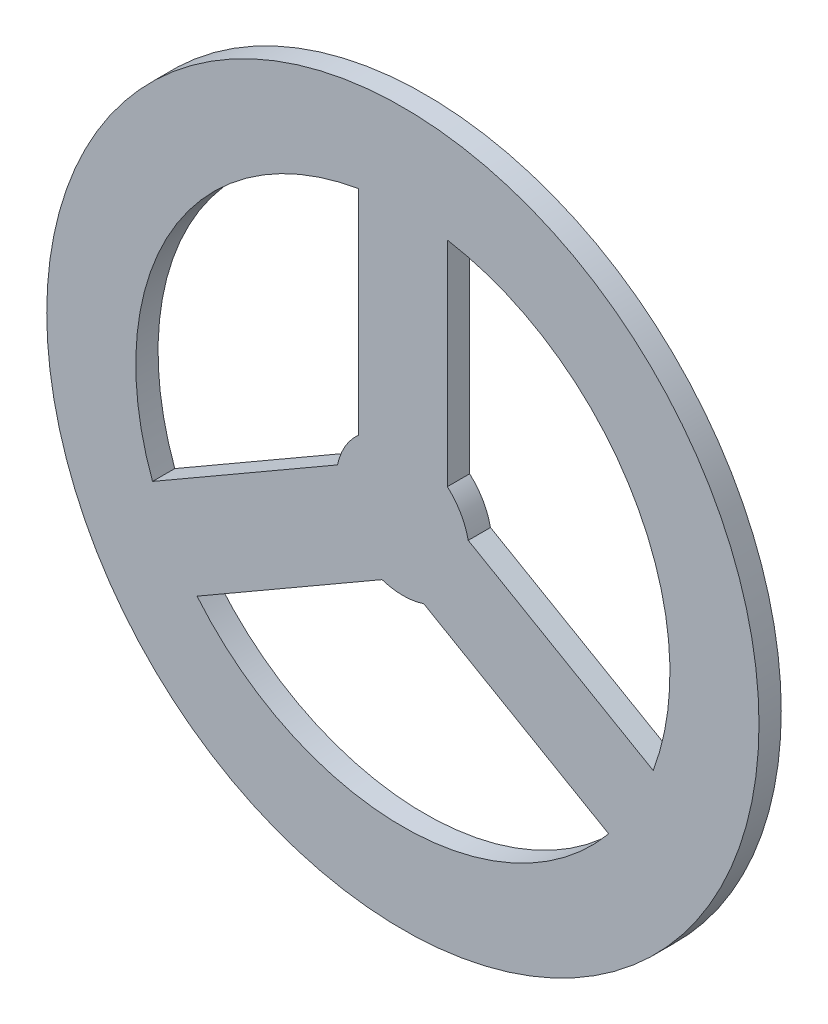
ISO-10303-21;
HEADER;
FILE_DESCRIPTION(('STEP AP214'),'2;1');
FILE_NAME('part.step','',(''),(''),'','','');
FILE_SCHEMA(('AUTOMOTIVE_DESIGN { 1 0 10303 214 1 1 1 1 }'));
ENDSEC;
DATA;
#1=APPLICATION_CONTEXT('core data for automotive mechanical design processes');
#2=APPLICATION_PROTOCOL_DEFINITION('international standard','automotive_design',2000,#1);
#3=PRODUCT_CONTEXT('',#1,'mechanical');
#4=PRODUCT('Part','Part','',(#3));
#5=PRODUCT_RELATED_PRODUCT_CATEGORY('part','',(#4));
#6=PRODUCT_DEFINITION_FORMATION('','',#4);
#7=PRODUCT_DEFINITION_CONTEXT('part definition',#1,'design');
#8=PRODUCT_DEFINITION('design','',#6,#7);
#9=PRODUCT_DEFINITION_SHAPE('','',#8);
#10=(LENGTH_UNIT() NAMED_UNIT(*) SI_UNIT(.MILLI.,.METRE.));
#11=(NAMED_UNIT(*) PLANE_ANGLE_UNIT() SI_UNIT($,.RADIAN.));
#12=(NAMED_UNIT(*) SI_UNIT($,.STERADIAN.) SOLID_ANGLE_UNIT());
#13=UNCERTAINTY_MEASURE_WITH_UNIT(LENGTH_MEASURE(1.E-05),#10,'distance_accuracy_value','');
#14=(GEOMETRIC_REPRESENTATION_CONTEXT(3) GLOBAL_UNCERTAINTY_ASSIGNED_CONTEXT((#13)) GLOBAL_UNIT_ASSIGNED_CONTEXT((#10,
#11,#12)) REPRESENTATION_CONTEXT('',''));
#15=CARTESIAN_POINT('',(0.,0.,0.));
#16=DIRECTION('',(0.,0.,1.));
#17=DIRECTION('',(1.,0.,0.));
#18=AXIS2_PLACEMENT_3D('',#15,#16,#17);
#19=CARTESIAN_POINT('',(0.,0.,6.35));
#20=DIRECTION('',(0.,0.,1.));
#21=DIRECTION('',(1.,0.,0.));
#22=AXIS2_PLACEMENT_3D('',#19,#20,#21);
#23=PLANE('',#22);
#24=CARTESIAN_POINT('',(0.,0.,6.35));
#25=DIRECTION('',(0.,0.,1.));
#26=DIRECTION('',(1.,0.,0.));
#27=AXIS2_PLACEMENT_3D('',#24,#25,#26);
#28=CIRCLE('',#27,101.6);
#29=CARTESIAN_POINT('',(101.6,0.,6.35));
#30=VERTEX_POINT('',#29);
#31=EDGE_CURVE('E11',#30,#30,#28,.T.);
#32=ORIENTED_EDGE('',*,*,#31,.T.);
#33=EDGE_LOOP('',(#32));
#34=FACE_BOUND('',#33,.T.);
#35=DIRECTION('',(0.866025403784436,-0.500000000000004,0.));
#36=VECTOR('',#35,1.);
#37=CARTESIAN_POINT('',(18.6467221242086,3.89900679950046,6.35));
#38=LINE('',#37,#36);
#39=CARTESIAN_POINT('',(18.6467221242086,3.89900679950046,6.35));
#40=VERTEX_POINT('',#39);
#41=CARTESIAN_POINT('',(71.4181373638433,-26.5685839946205,6.35));
#42=VERTEX_POINT('',#41);
#43=EDGE_CURVE('E191',#40,#42,#38,.T.);
#44=ORIENTED_EDGE('',*,*,#43,.F.);
#45=CARTESIAN_POINT('',(0.,0.,6.35));
#46=DIRECTION('',(0.,0.,-1.));
#47=DIRECTION('',(1.,0.,0.));
#48=AXIS2_PLACEMENT_3D('',#45,#46,#47);
#49=CIRCLE('',#48,19.05);
#50=CARTESIAN_POINT('',(12.7,14.1990316571237,6.35));
#51=VERTEX_POINT('',#50);
#52=EDGE_CURVE('E189',#51,#40,#49,.T.);
#53=ORIENTED_EDGE('',*,*,#52,.F.);
#54=DIRECTION('',(0.,-1.,0.));
#55=VECTOR('',#54,1.);
#56=CARTESIAN_POINT('',(12.7,14.1990316571237,6.35));
#57=LINE('',#56,#55);
#58=CARTESIAN_POINT('',(12.7,75.1342132453651,6.35));
#59=VERTEX_POINT('',#58);
#60=EDGE_CURVE('E197',#59,#51,#57,.T.);
#61=ORIENTED_EDGE('',*,*,#60,.F.);
#62=CARTESIAN_POINT('',(0.,0.,6.35));
#63=DIRECTION('',(0.,0.,1.));
#64=DIRECTION('',(1.,0.,0.));
#65=AXIS2_PLACEMENT_3D('',#62,#63,#64);
#66=CIRCLE('',#65,76.2);
#67=EDGE_CURVE('E194',#42,#59,#66,.T.);
#68=ORIENTED_EDGE('',*,*,#67,.F.);
#69=EDGE_LOOP('',(#44,#53,#61,#68));
#70=FACE_BOUND('',#69,.T.);
#71=DIRECTION('',(0.,1.,0.));
#72=VECTOR('',#71,1.);
#73=CARTESIAN_POINT('',(-12.7,14.1990316571237,6.35));
#74=LINE('',#73,#72);
#75=CARTESIAN_POINT('',(-12.7,14.1990316571237,6.35));
#76=VERTEX_POINT('',#75);
#77=CARTESIAN_POINT('',(-12.7,75.1342132453651,6.35));
#78=VERTEX_POINT('',#77);
#79=EDGE_CURVE('E160',#76,#78,#74,.T.);
#80=ORIENTED_EDGE('',*,*,#79,.F.);
#81=CARTESIAN_POINT('',(0.,0.,6.35));
#82=DIRECTION('',(0.,0.,-1.));
#83=DIRECTION('',(1.,0.,0.));
#84=AXIS2_PLACEMENT_3D('',#81,#82,#83);
#85=CIRCLE('',#84,19.05);
#86=CARTESIAN_POINT('',(-18.6467221242085,3.89900679950071,6.35));
#87=VERTEX_POINT('',#86);
#88=EDGE_CURVE('E158',#87,#76,#85,.T.);
#89=ORIENTED_EDGE('',*,*,#88,.F.);
#90=DIRECTION('',(0.866025403784443,0.499999999999992,0.));
#91=VECTOR('',#90,1.);
#92=CARTESIAN_POINT('',(-18.6467221242085,3.89900679950071,6.35));
#93=LINE('',#92,#91);
#94=CARTESIAN_POINT('',(-71.4181373638437,-26.5685839946195,6.35));
#95=VERTEX_POINT('',#94);
#96=EDGE_CURVE('E166',#95,#87,#93,.T.);
#97=ORIENTED_EDGE('',*,*,#96,.F.);
#98=CARTESIAN_POINT('',(0.,0.,6.35));
#99=DIRECTION('',(0.,0.,1.));
#100=DIRECTION('',(1.,0.,0.));
#101=AXIS2_PLACEMENT_3D('',#98,#99,#100);
#102=CIRCLE('',#101,76.2);
#103=EDGE_CURVE('E163',#78,#95,#102,.T.);
#104=ORIENTED_EDGE('',*,*,#103,.F.);
#105=EDGE_LOOP('',(#80,#89,#97,#104));
#106=FACE_BOUND('',#105,.T.);
#107=DIRECTION('',(-0.866025403784443,-0.499999999999992,0.));
#108=VECTOR('',#107,1.);
#109=CARTESIAN_POINT('',(-5.94672212420871,-18.0980384566241,6.35));
#110=LINE('',#109,#108);
#111=CARTESIAN_POINT('',(-5.94672212420871,-18.0980384566241,6.35));
#112=VERTEX_POINT('',#111);
#113=CARTESIAN_POINT('',(-58.7181373638439,-48.5656292507444,6.35));
#114=VERTEX_POINT('',#113);
#115=EDGE_CURVE('E130',#112,#114,#110,.T.);
#116=ORIENTED_EDGE('',*,*,#115,.F.);
#117=CARTESIAN_POINT('',(0.,0.,6.35));
#118=DIRECTION('',(0.,0.,-1.));
#119=DIRECTION('',(1.,0.,0.));
#120=AXIS2_PLACEMENT_3D('',#117,#118,#119);
#121=CIRCLE('',#120,19.05);
#122=CARTESIAN_POINT('',(5.94672212420847,-18.0980384566242,6.35));
#123=VERTEX_POINT('',#122);
#124=EDGE_CURVE('E122',#123,#112,#121,.T.);
#125=ORIENTED_EDGE('',*,*,#124,.F.);
#126=DIRECTION('',(-0.866025403784436,0.500000000000004,0.));
#127=VECTOR('',#126,1.);
#128=CARTESIAN_POINT('',(5.94672212420847,-18.0980384566242,6.35));
#129=LINE('',#128,#127);
#130=CARTESIAN_POINT('',(58.7181373638432,-48.5656292507452,6.35));
#131=VERTEX_POINT('',#130);
#132=EDGE_CURVE('E144',#131,#123,#129,.T.);
#133=ORIENTED_EDGE('',*,*,#132,.F.);
#134=CARTESIAN_POINT('',(0.,0.,6.35));
#135=DIRECTION('',(0.,0.,1.));
#136=DIRECTION('',(1.,0.,0.));
#137=AXIS2_PLACEMENT_3D('',#134,#135,#136);
#138=CIRCLE('',#137,76.2);
#139=EDGE_CURVE('E142',#114,#131,#138,.T.);
#140=ORIENTED_EDGE('',*,*,#139,.F.);
#141=EDGE_LOOP('',(#116,#125,#133,#140));
#142=FACE_BOUND('',#141,.T.);
#143=ADVANCED_FACE('F33',(#34,#70,#106,#142),#23,.T.);
#144=CARTESIAN_POINT('',(0.,0.,0.));
#145=DIRECTION('',(0.,0.,1.));
#146=DIRECTION('',(1.,0.,0.));
#147=AXIS2_PLACEMENT_3D('',#144,#145,#146);
#148=PLANE('',#147);
#149=CARTESIAN_POINT('',(0.,0.,0.));
#150=DIRECTION('',(0.,0.,-1.));
#151=DIRECTION('',(1.,0.,0.));
#152=AXIS2_PLACEMENT_3D('',#149,#150,#151);
#153=CIRCLE('',#152,19.05);
#154=CARTESIAN_POINT('',(-18.6467221242085,3.89900679950071,0.));
#155=VERTEX_POINT('',#154);
#156=CARTESIAN_POINT('',(-12.7,14.1990316571237,0.));
#157=VERTEX_POINT('',#156);
#158=EDGE_CURVE('E138',#155,#157,#153,.T.);
#159=ORIENTED_EDGE('',*,*,#158,.T.);
#160=DIRECTION('',(0.,1.,0.));
#161=VECTOR('',#160,1.);
#162=CARTESIAN_POINT('',(-12.7,14.1990316571237,0.));
#163=LINE('',#162,#161);
#164=CARTESIAN_POINT('',(-12.7,75.1342132453651,0.));
#165=VERTEX_POINT('',#164);
#166=EDGE_CURVE('E171',#157,#165,#163,.T.);
#167=ORIENTED_EDGE('',*,*,#166,.T.);
#168=CARTESIAN_POINT('',(0.,0.,0.));
#169=DIRECTION('',(0.,0.,1.));
#170=DIRECTION('',(1.,0.,0.));
#171=AXIS2_PLACEMENT_3D('',#168,#169,#170);
#172=CIRCLE('',#171,76.2);
#173=CARTESIAN_POINT('',(-71.4181373638437,-26.5685839946195,0.));
#174=VERTEX_POINT('',#173);
#175=EDGE_CURVE('E174',#165,#174,#172,.T.);
#176=ORIENTED_EDGE('',*,*,#175,.T.);
#177=DIRECTION('',(0.866025403784443,0.499999999999992,0.));
#178=VECTOR('',#177,1.);
#179=CARTESIAN_POINT('',(-18.6467221242085,3.89900679950071,0.));
#180=LINE('',#179,#178);
#181=EDGE_CURVE('E161',#174,#155,#180,.T.);
#182=ORIENTED_EDGE('',*,*,#181,.T.);
#183=EDGE_LOOP('',(#159,#167,#176,#182));
#184=FACE_BOUND('',#183,.T.);
#185=CARTESIAN_POINT('',(0.,0.,0.));
#186=DIRECTION('',(0.,0.,1.));
#187=DIRECTION('',(1.,0.,0.));
#188=AXIS2_PLACEMENT_3D('',#185,#186,#187);
#189=CIRCLE('',#188,101.6);
#190=CARTESIAN_POINT('',(101.6,0.,0.));
#191=VERTEX_POINT('',#190);
#192=EDGE_CURVE('E37',#191,#191,#189,.T.);
#193=ORIENTED_EDGE('',*,*,#192,.F.);
#194=EDGE_LOOP('',(#193));
#195=FACE_BOUND('',#194,.T.);
#196=CARTESIAN_POINT('',(0.,0.,0.));
#197=DIRECTION('',(0.,0.,-1.));
#198=DIRECTION('',(1.,0.,0.));
#199=AXIS2_PLACEMENT_3D('',#196,#197,#198);
#200=CIRCLE('',#199,19.05);
#201=CARTESIAN_POINT('',(12.7,14.1990316571237,0.));
#202=VERTEX_POINT('',#201);
#203=CARTESIAN_POINT('',(18.6467221242086,3.89900679950046,0.));
#204=VERTEX_POINT('',#203);
#205=EDGE_CURVE('E188',#202,#204,#200,.T.);
#206=ORIENTED_EDGE('',*,*,#205,.T.);
#207=DIRECTION('',(0.866025403784436,-0.500000000000004,0.));
#208=VECTOR('',#207,1.);
#209=CARTESIAN_POINT('',(18.6467221242086,3.89900679950046,0.));
#210=LINE('',#209,#208);
#211=CARTESIAN_POINT('',(71.4181373638433,-26.5685839946205,0.));
#212=VERTEX_POINT('',#211);
#213=EDGE_CURVE('E202',#204,#212,#210,.T.);
#214=ORIENTED_EDGE('',*,*,#213,.T.);
#215=CARTESIAN_POINT('',(0.,0.,0.));
#216=DIRECTION('',(0.,0.,1.));
#217=DIRECTION('',(1.,0.,0.));
#218=AXIS2_PLACEMENT_3D('',#215,#216,#217);
#219=CIRCLE('',#218,76.2);
#220=CARTESIAN_POINT('',(12.7,75.1342132453651,0.));
#221=VERTEX_POINT('',#220);
#222=EDGE_CURVE('E205',#212,#221,#219,.T.);
#223=ORIENTED_EDGE('',*,*,#222,.T.);
#224=DIRECTION('',(0.,-1.,0.));
#225=VECTOR('',#224,1.);
#226=CARTESIAN_POINT('',(12.7,14.1990316571237,0.));
#227=LINE('',#226,#225);
#228=EDGE_CURVE('E192',#221,#202,#227,.T.);
#229=ORIENTED_EDGE('',*,*,#228,.T.);
#230=EDGE_LOOP('',(#206,#214,#223,#229));
#231=FACE_BOUND('',#230,.T.);
#232=CARTESIAN_POINT('',(0.,0.,0.));
#233=DIRECTION('',(0.,0.,-1.));
#234=DIRECTION('',(1.,0.,0.));
#235=AXIS2_PLACEMENT_3D('',#232,#233,#234);
#236=CIRCLE('',#235,19.05);
#237=CARTESIAN_POINT('',(5.94672212420847,-18.0980384566242,0.));
#238=VERTEX_POINT('',#237);
#239=CARTESIAN_POINT('',(-5.94672212420871,-18.0980384566241,0.));
#240=VERTEX_POINT('',#239);
#241=EDGE_CURVE('E56',#238,#240,#236,.T.);
#242=ORIENTED_EDGE('',*,*,#241,.T.);
#243=DIRECTION('',(-0.866025403784443,-0.499999999999992,0.));
#244=VECTOR('',#243,1.);
#245=CARTESIAN_POINT('',(-5.94672212420871,-18.0980384566241,0.));
#246=LINE('',#245,#244);
#247=CARTESIAN_POINT('',(-58.7181373638439,-48.5656292507444,0.));
#248=VERTEX_POINT('',#247);
#249=EDGE_CURVE('E137',#240,#248,#246,.T.);
#250=ORIENTED_EDGE('',*,*,#249,.T.);
#251=CARTESIAN_POINT('',(0.,0.,0.));
#252=DIRECTION('',(0.,0.,1.));
#253=DIRECTION('',(1.,0.,0.));
#254=AXIS2_PLACEMENT_3D('',#251,#252,#253);
#255=CIRCLE('',#254,76.2);
#256=CARTESIAN_POINT('',(58.7181373638432,-48.5656292507452,0.));
#257=VERTEX_POINT('',#256);
#258=EDGE_CURVE('E150',#248,#257,#255,.T.);
#259=ORIENTED_EDGE('',*,*,#258,.T.);
#260=DIRECTION('',(-0.866025403784436,0.500000000000004,0.));
#261=VECTOR('',#260,1.);
#262=CARTESIAN_POINT('',(5.94672212420847,-18.0980384566242,0.));
#263=LINE('',#262,#261);
#264=EDGE_CURVE('E131',#257,#238,#263,.T.);
#265=ORIENTED_EDGE('',*,*,#264,.T.);
#266=EDGE_LOOP('',(#242,#250,#259,#265));
#267=FACE_BOUND('',#266,.T.);
#268=ADVANCED_FACE('F224',(#184,#195,#231,#267),#148,.F.);
#269=CARTESIAN_POINT('',(0.,0.,6.35));
#270=DIRECTION('',(0.,0.,-1.));
#271=DIRECTION('',(-1.,0.,0.));
#272=AXIS2_PLACEMENT_3D('',#269,#270,#271);
#273=CYLINDRICAL_SURFACE('',#272,101.6);
#274=ORIENTED_EDGE('',*,*,#31,.F.);
#275=EDGE_LOOP('',(#274));
#276=FACE_BOUND('',#275,.T.);
#277=ORIENTED_EDGE('',*,*,#192,.T.);
#278=EDGE_LOOP('',(#277));
#279=FACE_BOUND('',#278,.T.);
#280=ADVANCED_FACE('F35',(#276,#279),#273,.T.);
#281=CARTESIAN_POINT('',(0.,0.,6.35));
#282=DIRECTION('',(0.,0.,-1.));
#283=DIRECTION('',(-1.,0.,0.));
#284=AXIS2_PLACEMENT_3D('',#281,#282,#283);
#285=CYLINDRICAL_SURFACE('',#284,19.05);
#286=ORIENTED_EDGE('',*,*,#205,.F.);
#287=DIRECTION('',(0.,0.,-1.));
#288=VECTOR('',#287,1.);
#289=CARTESIAN_POINT('',(12.7,14.1990316571237,6.35));
#290=LINE('',#289,#288);
#291=EDGE_CURVE('E199',#51,#202,#290,.T.);
#292=ORIENTED_EDGE('',*,*,#291,.F.);
#293=ORIENTED_EDGE('',*,*,#52,.T.);
#294=DIRECTION('',(0.,0.,-1.));
#295=VECTOR('',#294,1.);
#296=CARTESIAN_POINT('',(18.6467221242086,3.89900679950046,6.35));
#297=LINE('',#296,#295);
#298=EDGE_CURVE('E216',#40,#204,#297,.T.);
#299=ORIENTED_EDGE('',*,*,#298,.T.);
#300=EDGE_LOOP('',(#286,#292,#293,#299));
#301=FACE_BOUND('',#300,.T.);
#302=ADVANCED_FACE('F246',(#301),#285,.T.);
#303=CARTESIAN_POINT('',(18.6467221242086,3.89900679950046,6.35));
#304=DIRECTION('',(0.500000000000004,0.866025403784436,0.));
#305=DIRECTION('',(-0.866025403784436,0.500000000000004,0.));
#306=AXIS2_PLACEMENT_3D('',#303,#304,#305);
#307=PLANE('',#306);
#308=ORIENTED_EDGE('',*,*,#213,.F.);
#309=ORIENTED_EDGE('',*,*,#298,.F.);
#310=ORIENTED_EDGE('',*,*,#43,.T.);
#311=DIRECTION('',(0.,0.,-1.));
#312=VECTOR('',#311,1.);
#313=CARTESIAN_POINT('',(71.4181373638433,-26.5685839946205,6.35));
#314=LINE('',#313,#312);
#315=EDGE_CURVE('E214',#42,#212,#314,.T.);
#316=ORIENTED_EDGE('',*,*,#315,.T.);
#317=EDGE_LOOP('',(#308,#309,#310,#316));
#318=FACE_BOUND('',#317,.T.);
#319=ADVANCED_FACE('F249',(#318),#307,.T.);
#320=CARTESIAN_POINT('',(0.,0.,6.35));
#321=DIRECTION('',(0.,0.,-1.));
#322=DIRECTION('',(-1.,0.,0.));
#323=AXIS2_PLACEMENT_3D('',#320,#321,#322);
#324=CYLINDRICAL_SURFACE('',#323,76.2);
#325=ORIENTED_EDGE('',*,*,#222,.F.);
#326=ORIENTED_EDGE('',*,*,#315,.F.);
#327=ORIENTED_EDGE('',*,*,#67,.T.);
#328=DIRECTION('',(0.,0.,-1.));
#329=VECTOR('',#328,1.);
#330=CARTESIAN_POINT('',(12.7,75.1342132453651,6.35));
#331=LINE('',#330,#329);
#332=EDGE_CURVE('E212',#59,#221,#331,.T.);
#333=ORIENTED_EDGE('',*,*,#332,.T.);
#334=EDGE_LOOP('',(#325,#326,#327,#333));
#335=FACE_BOUND('',#334,.T.);
#336=ADVANCED_FACE('F252',(#335),#324,.F.);
#337=CARTESIAN_POINT('',(12.7,14.1990316571237,6.35));
#338=DIRECTION('',(1.,0.,0.));
#339=DIRECTION('',(0.,0.,-1.));
#340=AXIS2_PLACEMENT_3D('',#337,#338,#339);
#341=PLANE('',#340);
#342=ORIENTED_EDGE('',*,*,#228,.F.);
#343=ORIENTED_EDGE('',*,*,#332,.F.);
#344=ORIENTED_EDGE('',*,*,#60,.T.);
#345=ORIENTED_EDGE('',*,*,#291,.T.);
#346=EDGE_LOOP('',(#342,#343,#344,#345));
#347=FACE_BOUND('',#346,.T.);
#348=ADVANCED_FACE('F256',(#347),#341,.T.);
#349=CARTESIAN_POINT('',(0.,0.,6.35));
#350=DIRECTION('',(0.,0.,-1.));
#351=DIRECTION('',(-1.,0.,0.));
#352=AXIS2_PLACEMENT_3D('',#349,#350,#351);
#353=CYLINDRICAL_SURFACE('',#352,19.05);
#354=ORIENTED_EDGE('',*,*,#158,.F.);
#355=DIRECTION('',(0.,0.,-1.));
#356=VECTOR('',#355,1.);
#357=CARTESIAN_POINT('',(-18.6467221242085,3.89900679950071,6.35));
#358=LINE('',#357,#356);
#359=EDGE_CURVE('E168',#87,#155,#358,.T.);
#360=ORIENTED_EDGE('',*,*,#359,.F.);
#361=ORIENTED_EDGE('',*,*,#88,.T.);
#362=DIRECTION('',(0.,0.,-1.));
#363=VECTOR('',#362,1.);
#364=CARTESIAN_POINT('',(-12.7,14.1990316571237,6.35));
#365=LINE('',#364,#363);
#366=EDGE_CURVE('E185',#76,#157,#365,.T.);
#367=ORIENTED_EDGE('',*,*,#366,.T.);
#368=EDGE_LOOP('',(#354,#360,#361,#367));
#369=FACE_BOUND('',#368,.T.);
#370=ADVANCED_FACE('F260',(#369),#353,.T.);
#371=CARTESIAN_POINT('',(-12.7,14.1990316571237,6.35));
#372=DIRECTION('',(-1.,0.,0.));
#373=DIRECTION('',(0.,0.,1.));
#374=AXIS2_PLACEMENT_3D('',#371,#372,#373);
#375=PLANE('',#374);
#376=ORIENTED_EDGE('',*,*,#166,.F.);
#377=ORIENTED_EDGE('',*,*,#366,.F.);
#378=ORIENTED_EDGE('',*,*,#79,.T.);
#379=DIRECTION('',(0.,0.,-1.));
#380=VECTOR('',#379,1.);
#381=CARTESIAN_POINT('',(-12.7,75.1342132453651,6.35));
#382=LINE('',#381,#380);
#383=EDGE_CURVE('E183',#78,#165,#382,.T.);
#384=ORIENTED_EDGE('',*,*,#383,.T.);
#385=EDGE_LOOP('',(#376,#377,#378,#384));
#386=FACE_BOUND('',#385,.T.);
#387=ADVANCED_FACE('F264',(#386),#375,.T.);
#388=CARTESIAN_POINT('',(0.,0.,6.35));
#389=DIRECTION('',(0.,0.,-1.));
#390=DIRECTION('',(-1.,0.,0.));
#391=AXIS2_PLACEMENT_3D('',#388,#389,#390);
#392=CYLINDRICAL_SURFACE('',#391,76.2);
#393=ORIENTED_EDGE('',*,*,#175,.F.);
#394=ORIENTED_EDGE('',*,*,#383,.F.);
#395=ORIENTED_EDGE('',*,*,#103,.T.);
#396=DIRECTION('',(0.,0.,-1.));
#397=VECTOR('',#396,1.);
#398=CARTESIAN_POINT('',(-71.4181373638437,-26.5685839946195,6.35));
#399=LINE('',#398,#397);
#400=EDGE_CURVE('E181',#95,#174,#399,.T.);
#401=ORIENTED_EDGE('',*,*,#400,.T.);
#402=EDGE_LOOP('',(#393,#394,#395,#401));
#403=FACE_BOUND('',#402,.T.);
#404=ADVANCED_FACE('F268',(#403),#392,.F.);
#405=CARTESIAN_POINT('',(-18.6467221242085,3.89900679950071,6.35));
#406=DIRECTION('',(-0.499999999999992,0.866025403784443,0.));
#407=DIRECTION('',(-0.866025403784443,-0.499999999999992,0.));
#408=AXIS2_PLACEMENT_3D('',#405,#406,#407);
#409=PLANE('',#408);
#410=ORIENTED_EDGE('',*,*,#181,.F.);
#411=ORIENTED_EDGE('',*,*,#400,.F.);
#412=ORIENTED_EDGE('',*,*,#96,.T.);
#413=ORIENTED_EDGE('',*,*,#359,.T.);
#414=EDGE_LOOP('',(#410,#411,#412,#413));
#415=FACE_BOUND('',#414,.T.);
#416=ADVANCED_FACE('F272',(#415),#409,.T.);
#417=CARTESIAN_POINT('',(0.,0.,6.35));
#418=DIRECTION('',(0.,0.,-1.));
#419=DIRECTION('',(-1.,0.,0.));
#420=AXIS2_PLACEMENT_3D('',#417,#418,#419);
#421=CYLINDRICAL_SURFACE('',#420,19.05);
#422=ORIENTED_EDGE('',*,*,#241,.F.);
#423=DIRECTION('',(0.,0.,-1.));
#424=VECTOR('',#423,1.);
#425=CARTESIAN_POINT('',(5.94672212420847,-18.0980384566242,6.35));
#426=LINE('',#425,#424);
#427=EDGE_CURVE('E126',#123,#238,#426,.T.);
#428=ORIENTED_EDGE('',*,*,#427,.F.);
#429=ORIENTED_EDGE('',*,*,#124,.T.);
#430=DIRECTION('',(0.,0.,-1.));
#431=VECTOR('',#430,1.);
#432=CARTESIAN_POINT('',(-5.94672212420871,-18.0980384566241,6.35));
#433=LINE('',#432,#431);
#434=EDGE_CURVE('E125',#112,#240,#433,.T.);
#435=ORIENTED_EDGE('',*,*,#434,.T.);
#436=EDGE_LOOP('',(#422,#428,#429,#435));
#437=FACE_BOUND('',#436,.T.);
#438=ADVANCED_FACE('F124',(#437),#421,.T.);
#439=CARTESIAN_POINT('',(-5.94672212420871,-18.0980384566241,6.35));
#440=DIRECTION('',(0.499999999999992,-0.866025403784443,0.));
#441=DIRECTION('',(0.866025403784443,0.499999999999992,0.));
#442=AXIS2_PLACEMENT_3D('',#439,#440,#441);
#443=PLANE('',#442);
#444=ORIENTED_EDGE('',*,*,#249,.F.);
#445=ORIENTED_EDGE('',*,*,#434,.F.);
#446=ORIENTED_EDGE('',*,*,#115,.T.);
#447=DIRECTION('',(0.,0.,-1.));
#448=VECTOR('',#447,1.);
#449=CARTESIAN_POINT('',(-58.7181373638439,-48.5656292507444,6.35));
#450=LINE('',#449,#448);
#451=EDGE_CURVE('E139',#114,#248,#450,.T.);
#452=ORIENTED_EDGE('',*,*,#451,.T.);
#453=EDGE_LOOP('',(#444,#445,#446,#452));
#454=FACE_BOUND('',#453,.T.);
#455=ADVANCED_FACE('F134',(#454),#443,.T.);
#456=CARTESIAN_POINT('',(0.,0.,6.35));
#457=DIRECTION('',(0.,0.,-1.));
#458=DIRECTION('',(-1.,0.,0.));
#459=AXIS2_PLACEMENT_3D('',#456,#457,#458);
#460=CYLINDRICAL_SURFACE('',#459,76.2);
#461=ORIENTED_EDGE('',*,*,#258,.F.);
#462=ORIENTED_EDGE('',*,*,#451,.F.);
#463=ORIENTED_EDGE('',*,*,#139,.T.);
#464=DIRECTION('',(0.,0.,-1.));
#465=VECTOR('',#464,1.);
#466=CARTESIAN_POINT('',(58.7181373638432,-48.5656292507452,6.35));
#467=LINE('',#466,#465);
#468=EDGE_CURVE('E48',#131,#257,#467,.T.);
#469=ORIENTED_EDGE('',*,*,#468,.T.);
#470=EDGE_LOOP('',(#461,#462,#463,#469));
#471=FACE_BOUND('',#470,.T.);
#472=ADVANCED_FACE('F232',(#471),#460,.F.);
#473=CARTESIAN_POINT('',(5.94672212420847,-18.0980384566242,6.35));
#474=DIRECTION('',(-0.500000000000004,-0.866025403784436,0.));
#475=DIRECTION('',(0.866025403784436,-0.500000000000004,0.));
#476=AXIS2_PLACEMENT_3D('',#473,#474,#475);
#477=PLANE('',#476);
#478=ORIENTED_EDGE('',*,*,#264,.F.);
#479=ORIENTED_EDGE('',*,*,#468,.F.);
#480=ORIENTED_EDGE('',*,*,#132,.T.);
#481=ORIENTED_EDGE('',*,*,#427,.T.);
#482=EDGE_LOOP('',(#478,#479,#480,#481));
#483=FACE_BOUND('',#482,.T.);
#484=ADVANCED_FACE('F230',(#483),#477,.T.);
#485=CLOSED_SHELL('',(#143,#268,#280,#302,#319,#336,#348,#370,#387,#404,#416,#438,#455,#472,#484));
#486=MANIFOLD_SOLID_BREP('B2',#485);
#487=ADVANCED_BREP_SHAPE_REPRESENTATION('',(#18,#486),#14);
#488=SHAPE_DEFINITION_REPRESENTATION(#9,#487);
ENDSEC;
END-ISO-10303-21;
